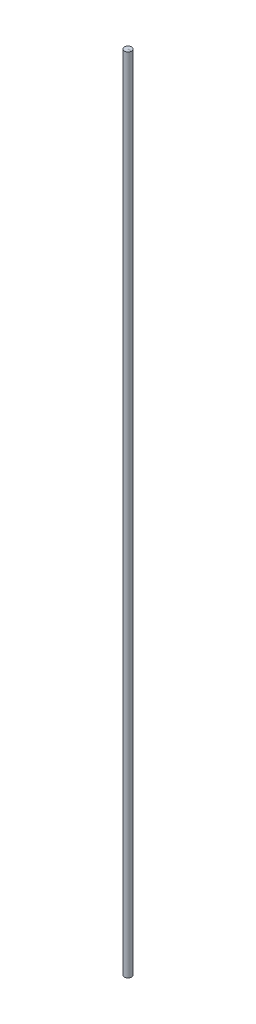
ISO-10303-21;
HEADER;
FILE_DESCRIPTION(('STEP AP214'),'2;1');
FILE_NAME('part.step','',(''),(''),'','','');
FILE_SCHEMA(('AUTOMOTIVE_DESIGN { 1 0 10303 214 1 1 1 1 }'));
ENDSEC;
DATA;
#1=APPLICATION_CONTEXT('core data for automotive mechanical design processes');
#2=APPLICATION_PROTOCOL_DEFINITION('international standard','automotive_design',2000,#1);
#3=PRODUCT_CONTEXT('',#1,'mechanical');
#4=PRODUCT('Part','Part','',(#3));
#5=PRODUCT_RELATED_PRODUCT_CATEGORY('part','',(#4));
#6=PRODUCT_DEFINITION_FORMATION('','',#4);
#7=PRODUCT_DEFINITION_CONTEXT('part definition',#1,'design');
#8=PRODUCT_DEFINITION('design','',#6,#7);
#9=PRODUCT_DEFINITION_SHAPE('','',#8);
#10=(LENGTH_UNIT() NAMED_UNIT(*) SI_UNIT(.MILLI.,.METRE.));
#11=(NAMED_UNIT(*) PLANE_ANGLE_UNIT() SI_UNIT($,.RADIAN.));
#12=(NAMED_UNIT(*) SI_UNIT($,.STERADIAN.) SOLID_ANGLE_UNIT());
#13=UNCERTAINTY_MEASURE_WITH_UNIT(LENGTH_MEASURE(1.E-05),#10,'distance_accuracy_value','');
#14=(GEOMETRIC_REPRESENTATION_CONTEXT(3) GLOBAL_UNCERTAINTY_ASSIGNED_CONTEXT((#13)) GLOBAL_UNIT_ASSIGNED_CONTEXT((#10,
#11,#12)) REPRESENTATION_CONTEXT('',''));
#15=CARTESIAN_POINT('',(0.,0.,0.));
#16=DIRECTION('',(0.,0.,1.));
#17=DIRECTION('',(1.,0.,0.));
#18=AXIS2_PLACEMENT_3D('',#15,#16,#17);
#19=CARTESIAN_POINT('',(0.,440.000000112,0.));
#20=DIRECTION('',(0.,-1.,0.));
#21=DIRECTION('',(0.,0.,-1.));
#22=AXIS2_PLACEMENT_3D('',#19,#20,#21);
#23=CYLINDRICAL_SURFACE('',#22,2.);
#24=CARTESIAN_POINT('',(0.,440.000000112,0.));
#25=DIRECTION('',(0.,1.,0.));
#26=DIRECTION('',(0.,0.,1.));
#27=AXIS2_PLACEMENT_3D('',#24,#25,#26);
#28=CIRCLE('',#27,2.);
#29=CARTESIAN_POINT('',(2.,440.000000112,0.));
#30=VERTEX_POINT('',#29);
#31=EDGE_CURVE('E11',#30,#30,#28,.T.);
#32=ORIENTED_EDGE('',*,*,#31,.F.);
#33=EDGE_LOOP('',(#32));
#34=FACE_BOUND('',#33,.T.);
#35=CARTESIAN_POINT('',(0.,0.,0.));
#36=DIRECTION('',(0.,1.,0.));
#37=DIRECTION('',(0.,0.,1.));
#38=AXIS2_PLACEMENT_3D('',#35,#36,#37);
#39=CIRCLE('',#38,2.);
#40=CARTESIAN_POINT('',(2.,0.,0.));
#41=VERTEX_POINT('',#40);
#42=EDGE_CURVE('E40',#41,#41,#39,.T.);
#43=ORIENTED_EDGE('',*,*,#42,.T.);
#44=EDGE_LOOP('',(#43));
#45=FACE_BOUND('',#44,.T.);
#46=ADVANCED_FACE('F37',(#34,#45),#23,.T.);
#47=CARTESIAN_POINT('',(0.,440.000000112,0.));
#48=DIRECTION('',(0.,1.,0.));
#49=DIRECTION('',(0.,0.,1.));
#50=AXIS2_PLACEMENT_3D('',#47,#48,#49);
#51=PLANE('',#50);
#52=DIRECTION('',(0.,0.,1.));
#53=VECTOR('',#52,1.);
#54=CARTESIAN_POINT('',(0.,440.000000112,0.));
#55=LINE('',#54,#53);
#56=CARTESIAN_POINT('',(0.,440.000000112,0.));
#57=VERTEX_POINT('',#56);
#58=CARTESIAN_POINT('',(0.,440.000000112,0.161399324188014));
#59=VERTEX_POINT('',#58);
#60=EDGE_CURVE('E59',#57,#59,#55,.T.);
#61=ORIENTED_EDGE('',*,*,#60,.F.);
#62=DIRECTION('',(-1.,0.,0.));
#63=VECTOR('',#62,1.);
#64=CARTESIAN_POINT('',(0.,440.000000112,0.));
#65=LINE('',#64,#63);
#66=EDGE_CURVE('E123',#30,#57,#65,.T.);
#67=ORIENTED_EDGE('',*,*,#66,.F.);
#68=ORIENTED_EDGE('',*,*,#31,.T.);
#69=DIRECTION('',(0.996759600874991,0.,-0.0804381629795691));
#70=VECTOR('',#69,1.);
#71=CARTESIAN_POINT('',(0.,440.000000112,0.161399324188014));
#72=LINE('',#71,#70);
#73=EDGE_CURVE('E129',#59,#30,#72,.T.);
#74=ORIENTED_EDGE('',*,*,#73,.F.);
#75=EDGE_LOOP('',(#61,#67,#68,#74));
#76=FACE_BOUND('',#75,.T.);
#77=ADVANCED_FACE('F159',(#76),#51,.T.);
#78=CARTESIAN_POINT('',(0.,0.,0.));
#79=DIRECTION('',(0.,1.,0.));
#80=DIRECTION('',(0.,0.,1.));
#81=AXIS2_PLACEMENT_3D('',#78,#79,#80);
#82=PLANE('',#81);
#83=DIRECTION('',(-1.,0.,0.));
#84=VECTOR('',#83,1.);
#85=CARTESIAN_POINT('',(0.,0.,0.));
#86=LINE('',#85,#84);
#87=CARTESIAN_POINT('',(0.,0.,0.));
#88=VERTEX_POINT('',#87);
#89=EDGE_CURVE('E113',#41,#88,#86,.T.);
#90=ORIENTED_EDGE('',*,*,#89,.T.);
#91=DIRECTION('',(0.,0.,1.));
#92=VECTOR('',#91,1.);
#93=CARTESIAN_POINT('',(0.,0.,0.));
#94=LINE('',#93,#92);
#95=CARTESIAN_POINT('',(0.,0.,0.161399324188014));
#96=VERTEX_POINT('',#95);
#97=EDGE_CURVE('E51',#88,#96,#94,.T.);
#98=ORIENTED_EDGE('',*,*,#97,.T.);
#99=DIRECTION('',(0.996759600874991,0.,-0.0804381629795691));
#100=VECTOR('',#99,1.);
#101=CARTESIAN_POINT('',(0.,0.,0.161399324188014));
#102=LINE('',#101,#100);
#103=EDGE_CURVE('E105',#96,#41,#102,.T.);
#104=ORIENTED_EDGE('',*,*,#103,.T.);
#105=ORIENTED_EDGE('',*,*,#42,.F.);
#106=EDGE_LOOP('',(#90,#98,#104,#105));
#107=FACE_BOUND('',#106,.T.);
#108=ADVANCED_FACE('F146',(#107),#82,.F.);
#109=CARTESIAN_POINT('',(0.,440.025400112,0.));
#110=DIRECTION('',(1.,0.,0.));
#111=DIRECTION('',(0.,0.,-1.));
#112=AXIS2_PLACEMENT_3D('',#109,#110,#111);
#113=PLANE('',#112);
#114=ORIENTED_EDGE('',*,*,#60,.T.);
#115=DIRECTION('',(0.,-1.,0.));
#116=VECTOR('',#115,1.);
#117=CARTESIAN_POINT('',(0.,440.025400112,0.161399324188014));
#118=LINE('',#117,#116);
#119=CARTESIAN_POINT('',(0.,440.025400112,0.161399324188014));
#120=VERTEX_POINT('',#119);
#121=EDGE_CURVE('E138',#120,#59,#118,.T.);
#122=ORIENTED_EDGE('',*,*,#121,.F.);
#123=DIRECTION('',(0.,0.,1.));
#124=VECTOR('',#123,1.);
#125=CARTESIAN_POINT('',(0.,440.025400112,0.));
#126=LINE('',#125,#124);
#127=CARTESIAN_POINT('',(0.,440.025400112,0.));
#128=VERTEX_POINT('',#127);
#129=EDGE_CURVE('E119',#128,#120,#126,.T.);
#130=ORIENTED_EDGE('',*,*,#129,.F.);
#131=DIRECTION('',(0.,-1.,0.));
#132=VECTOR('',#131,1.);
#133=CARTESIAN_POINT('',(0.,440.025400112,0.));
#134=LINE('',#133,#132);
#135=EDGE_CURVE('E127',#128,#57,#134,.T.);
#136=ORIENTED_EDGE('',*,*,#135,.T.);
#137=EDGE_LOOP('',(#114,#122,#130,#136));
#138=FACE_BOUND('',#137,.T.);
#139=ADVANCED_FACE('F175',(#138),#113,.F.);
#140=CARTESIAN_POINT('',(0.,440.025400112,0.161399324188014));
#141=DIRECTION('',(-0.0804381629795691,0.,-0.996759600874991));
#142=DIRECTION('',(-0.996759600874991,0.,0.0804381629795691));
#143=AXIS2_PLACEMENT_3D('',#140,#141,#142);
#144=PLANE('',#143);
#145=ORIENTED_EDGE('',*,*,#73,.T.);
#146=DIRECTION('',(0.,-1.,0.));
#147=VECTOR('',#146,1.);
#148=CARTESIAN_POINT('',(2.,440.025400112,0.));
#149=LINE('',#148,#147);
#150=CARTESIAN_POINT('',(2.,440.025400112,0.));
#151=VERTEX_POINT('',#150);
#152=EDGE_CURVE('E135',#151,#30,#149,.T.);
#153=ORIENTED_EDGE('',*,*,#152,.F.);
#154=DIRECTION('',(0.996759600874991,0.,-0.0804381629795691));
#155=VECTOR('',#154,1.);
#156=CARTESIAN_POINT('',(0.,440.025400112,0.161399324188014));
#157=LINE('',#156,#155);
#158=EDGE_CURVE('E122',#120,#151,#157,.T.);
#159=ORIENTED_EDGE('',*,*,#158,.F.);
#160=ORIENTED_EDGE('',*,*,#121,.T.);
#161=EDGE_LOOP('',(#145,#153,#159,#160));
#162=FACE_BOUND('',#161,.T.);
#163=ADVANCED_FACE('F168',(#162),#144,.F.);
#164=CARTESIAN_POINT('',(0.,440.025400112,0.));
#165=DIRECTION('',(0.,0.,1.));
#166=DIRECTION('',(1.,0.,0.));
#167=AXIS2_PLACEMENT_3D('',#164,#165,#166);
#168=PLANE('',#167);
#169=ORIENTED_EDGE('',*,*,#66,.T.);
#170=ORIENTED_EDGE('',*,*,#135,.F.);
#171=DIRECTION('',(-1.,0.,0.));
#172=VECTOR('',#171,1.);
#173=CARTESIAN_POINT('',(0.,440.025400112,0.));
#174=LINE('',#173,#172);
#175=EDGE_CURVE('E125',#151,#128,#174,.T.);
#176=ORIENTED_EDGE('',*,*,#175,.F.);
#177=ORIENTED_EDGE('',*,*,#152,.T.);
#178=EDGE_LOOP('',(#169,#170,#176,#177));
#179=FACE_BOUND('',#178,.T.);
#180=ADVANCED_FACE('F170',(#179),#168,.F.);
#181=CARTESIAN_POINT('',(0.,440.025400112,0.));
#182=DIRECTION('',(0.,1.,0.));
#183=DIRECTION('',(0.,0.,1.));
#184=AXIS2_PLACEMENT_3D('',#181,#182,#183);
#185=PLANE('',#184);
#186=ORIENTED_EDGE('',*,*,#129,.T.);
#187=ORIENTED_EDGE('',*,*,#158,.T.);
#188=ORIENTED_EDGE('',*,*,#175,.T.);
#189=EDGE_LOOP('',(#186,#187,#188));
#190=FACE_BOUND('',#189,.T.);
#191=ADVANCED_FACE('F173',(#190),#185,.T.);
#192=CARTESIAN_POINT('',(0.,-0.0254,0.));
#193=DIRECTION('',(-1.,0.,0.));
#194=DIRECTION('',(0.,0.,1.));
#195=AXIS2_PLACEMENT_3D('',#192,#193,#194);
#196=PLANE('',#195);
#197=ORIENTED_EDGE('',*,*,#97,.F.);
#198=DIRECTION('',(0.,1.,0.));
#199=VECTOR('',#198,1.);
#200=CARTESIAN_POINT('',(0.,-0.0254,0.));
#201=LINE('',#200,#199);
#202=CARTESIAN_POINT('',(0.,-0.0254,0.));
#203=VERTEX_POINT('',#202);
#204=EDGE_CURVE('E88',#203,#88,#201,.T.);
#205=ORIENTED_EDGE('',*,*,#204,.F.);
#206=DIRECTION('',(0.,0.,1.));
#207=VECTOR('',#206,1.);
#208=CARTESIAN_POINT('',(0.,-0.0254,0.));
#209=LINE('',#208,#207);
#210=CARTESIAN_POINT('',(0.,-0.0254,0.161399324188014));
#211=VERTEX_POINT('',#210);
#212=EDGE_CURVE('E91',#203,#211,#209,.T.);
#213=ORIENTED_EDGE('',*,*,#212,.T.);
#214=DIRECTION('',(0.,1.,0.));
#215=VECTOR('',#214,1.);
#216=CARTESIAN_POINT('',(0.,-0.0254,0.161399324188014));
#217=LINE('',#216,#215);
#218=EDGE_CURVE('E109',#211,#96,#217,.T.);
#219=ORIENTED_EDGE('',*,*,#218,.T.);
#220=EDGE_LOOP('',(#197,#205,#213,#219));
#221=FACE_BOUND('',#220,.T.);
#222=ADVANCED_FACE('F90',(#221),#196,.T.);
#223=CARTESIAN_POINT('',(0.,-0.0254,0.));
#224=DIRECTION('',(0.,0.,-1.));
#225=DIRECTION('',(-1.,0.,0.));
#226=AXIS2_PLACEMENT_3D('',#223,#224,#225);
#227=PLANE('',#226);
#228=ORIENTED_EDGE('',*,*,#89,.F.);
#229=DIRECTION('',(0.,1.,0.));
#230=VECTOR('',#229,1.);
#231=CARTESIAN_POINT('',(2.,-0.0254,0.));
#232=LINE('',#231,#230);
#233=CARTESIAN_POINT('',(2.,-0.0254,0.));
#234=VERTEX_POINT('',#233);
#235=EDGE_CURVE('E97',#234,#41,#232,.T.);
#236=ORIENTED_EDGE('',*,*,#235,.F.);
#237=DIRECTION('',(-1.,0.,0.));
#238=VECTOR('',#237,1.);
#239=CARTESIAN_POINT('',(0.,-0.0254,0.));
#240=LINE('',#239,#238);
#241=EDGE_CURVE('E102',#234,#203,#240,.T.);
#242=ORIENTED_EDGE('',*,*,#241,.T.);
#243=ORIENTED_EDGE('',*,*,#204,.T.);
#244=EDGE_LOOP('',(#228,#236,#242,#243));
#245=FACE_BOUND('',#244,.T.);
#246=ADVANCED_FACE('F107',(#245),#227,.T.);
#247=CARTESIAN_POINT('',(0.,-0.0254,0.161399324188014));
#248=DIRECTION('',(0.0804381629795691,0.,0.996759600874991));
#249=DIRECTION('',(0.996759600874991,0.,-0.0804381629795691));
#250=AXIS2_PLACEMENT_3D('',#247,#248,#249);
#251=PLANE('',#250);
#252=ORIENTED_EDGE('',*,*,#103,.F.);
#253=ORIENTED_EDGE('',*,*,#218,.F.);
#254=DIRECTION('',(0.996759600874991,0.,-0.0804381629795691));
#255=VECTOR('',#254,1.);
#256=CARTESIAN_POINT('',(0.,-0.0254,0.161399324188014));
#257=LINE('',#256,#255);
#258=EDGE_CURVE('E104',#211,#234,#257,.T.);
#259=ORIENTED_EDGE('',*,*,#258,.T.);
#260=ORIENTED_EDGE('',*,*,#235,.T.);
#261=EDGE_LOOP('',(#252,#253,#259,#260));
#262=FACE_BOUND('',#261,.T.);
#263=ADVANCED_FACE('F149',(#262),#251,.T.);
#264=CARTESIAN_POINT('',(0.,-0.0254,0.));
#265=DIRECTION('',(0.,-1.,0.));
#266=DIRECTION('',(0.,0.,1.));
#267=AXIS2_PLACEMENT_3D('',#264,#265,#266);
#268=PLANE('',#267);
#269=ORIENTED_EDGE('',*,*,#212,.F.);
#270=ORIENTED_EDGE('',*,*,#241,.F.);
#271=ORIENTED_EDGE('',*,*,#258,.F.);
#272=EDGE_LOOP('',(#269,#270,#271));
#273=FACE_BOUND('',#272,.T.);
#274=ADVANCED_FACE('F101',(#273),#268,.T.);
#275=CLOSED_SHELL('',(#46,#77,#108,#139,#163,#180,#191,#222,#246,#263,#274));
#276=MANIFOLD_SOLID_BREP('B2',#275);
#277=ADVANCED_BREP_SHAPE_REPRESENTATION('',(#18,#276),#14);
#278=SHAPE_DEFINITION_REPRESENTATION(#9,#277);
ENDSEC;
END-ISO-10303-21;
